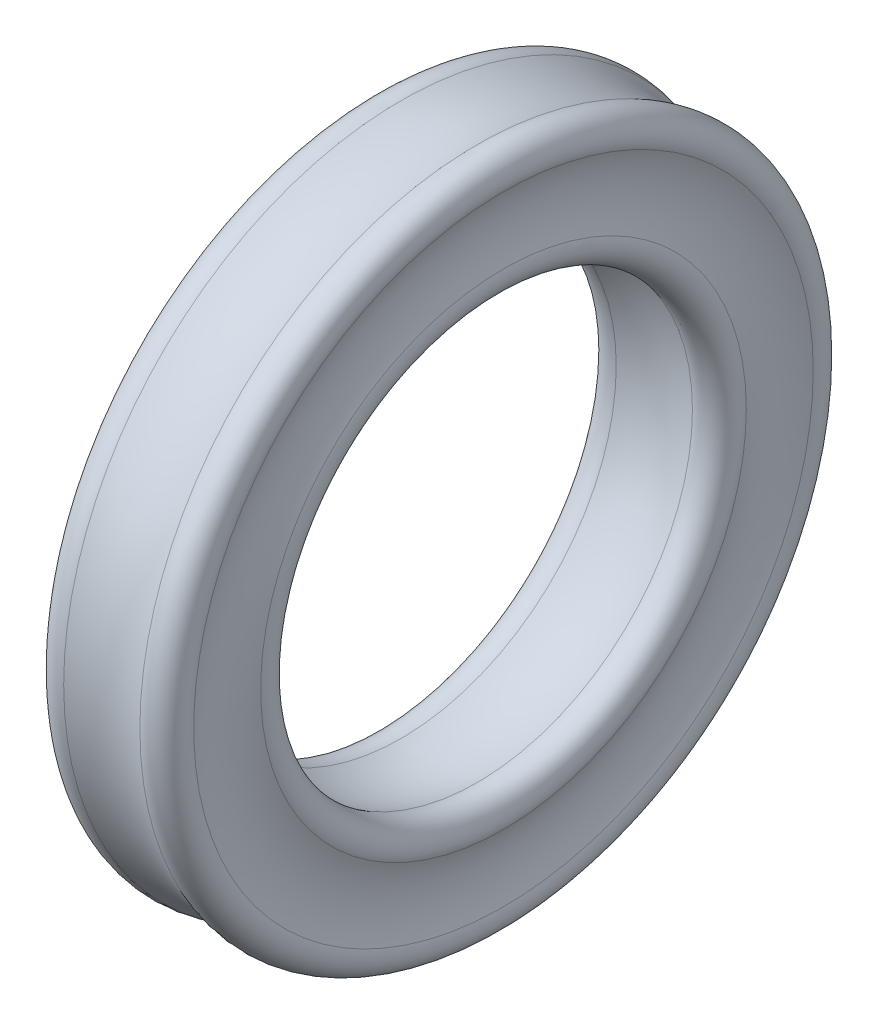
ISO-10303-21;
HEADER;
FILE_DESCRIPTION(('STEP AP214'),'2;1');
FILE_NAME('part.step','',(''),(''),'','','');
FILE_SCHEMA(('AUTOMOTIVE_DESIGN { 1 0 10303 214 1 1 1 1 }'));
ENDSEC;
DATA;
#1=APPLICATION_CONTEXT('core data for automotive mechanical design processes');
#2=APPLICATION_PROTOCOL_DEFINITION('international standard','automotive_design',2000,#1);
#3=PRODUCT_CONTEXT('',#1,'mechanical');
#4=PRODUCT('Part','Part','',(#3));
#5=PRODUCT_RELATED_PRODUCT_CATEGORY('part','',(#4));
#6=PRODUCT_DEFINITION_FORMATION('','',#4);
#7=PRODUCT_DEFINITION_CONTEXT('part definition',#1,'design');
#8=PRODUCT_DEFINITION('design','',#6,#7);
#9=PRODUCT_DEFINITION_SHAPE('','',#8);
#10=(LENGTH_UNIT() NAMED_UNIT(*) SI_UNIT(.MILLI.,.METRE.));
#11=(NAMED_UNIT(*) PLANE_ANGLE_UNIT() SI_UNIT($,.RADIAN.));
#12=(NAMED_UNIT(*) SI_UNIT($,.STERADIAN.) SOLID_ANGLE_UNIT());
#13=UNCERTAINTY_MEASURE_WITH_UNIT(LENGTH_MEASURE(1.E-05),#10,'distance_accuracy_value','');
#14=(GEOMETRIC_REPRESENTATION_CONTEXT(3) GLOBAL_UNCERTAINTY_ASSIGNED_CONTEXT((#13)) GLOBAL_UNIT_ASSIGNED_CONTEXT((#10,
#11,#12)) REPRESENTATION_CONTEXT('',''));
#15=CARTESIAN_POINT('',(0.,0.,0.));
#16=DIRECTION('',(0.,0.,1.));
#17=DIRECTION('',(1.,0.,0.));
#18=AXIS2_PLACEMENT_3D('',#15,#16,#17);
#19=CARTESIAN_POINT('',(0.,0.,0.));
#20=DIRECTION('',(1.,0.,0.));
#21=DIRECTION('',(0.,0.,-1.));
#22=AXIS2_PLACEMENT_3D('',#19,#20,#21);
#23=TOROIDAL_SURFACE('',#22,4.61618922012803,4.12518600000003);
#24=CARTESIAN_POINT('',(1.49686536342219,0.,0.));
#25=DIRECTION('',(1.,0.,0.));
#26=DIRECTION('',(0.,0.,-1.));
#27=AXIS2_PLACEMENT_3D('',#24,#25,#26);
#28=CIRCLE('',#27,8.46021752626512);
#29=CARTESIAN_POINT('',(1.49686536342219,0.,-8.46021752626512));
#30=VERTEX_POINT('',#29);
#31=EDGE_CURVE('E85',#30,#30,#28,.F.);
#32=ORIENTED_EDGE('',*,*,#31,.F.);
#33=EDGE_LOOP('',(#32));
#34=FACE_BOUND('',#33,.T.);
#35=CARTESIAN_POINT('',(-1.49686531743815,0.,0.));
#36=DIRECTION('',(1.,0.,0.));
#37=DIRECTION('',(0.,0.,-1.));
#38=AXIS2_PLACEMENT_3D('',#35,#36,#37);
#39=CIRCLE('',#38,8.46021754417131);
#40=CARTESIAN_POINT('',(-1.49686531743815,0.,-8.46021754417131));
#41=VERTEX_POINT('',#40);
#42=EDGE_CURVE('E82',#41,#41,#39,.T.);
#43=ORIENTED_EDGE('',*,*,#42,.F.);
#44=EDGE_LOOP('',(#43));
#45=FACE_BOUND('',#44,.T.);
#46=ADVANCED_FACE('F13',(#34,#45),#23,.F.);
#47=CARTESIAN_POINT('',(1.79084,0.,0.));
#48=DIRECTION('',(1.,0.,0.));
#49=DIRECTION('',(0.,0.,-1.));
#50=AXIS2_PLACEMENT_3D('',#47,#48,#49);
#51=TOROIDAL_SURFACE('',#50,9.21516,0.810159999999999);
#52=ORIENTED_EDGE('',*,*,#31,.T.);
#53=EDGE_LOOP('',(#52));
#54=FACE_BOUND('',#53,.T.);
#55=CARTESIAN_POINT('',(2.53259310120723,0.,0.));
#56=DIRECTION('',(1.,0.,0.));
#57=DIRECTION('',(0.,0.,-1.));
#58=AXIS2_PLACEMENT_3D('',#55,#56,#57);
#59=CIRCLE('',#58,9.5409844350098);
#60=CARTESIAN_POINT('',(2.53259310120723,0.,-9.5409844350098));
#61=VERTEX_POINT('',#60);
#62=EDGE_CURVE('E63',#61,#61,#59,.T.);
#63=ORIENTED_EDGE('',*,*,#62,.T.);
#64=EDGE_LOOP('',(#63));
#65=FACE_BOUND('',#64,.T.);
#66=ADVANCED_FACE('F76',(#54,#65),#51,.T.);
#67=CARTESIAN_POINT('',(-1.79084,0.,0.));
#68=DIRECTION('',(1.,0.,0.));
#69=DIRECTION('',(0.,0.,-1.));
#70=AXIS2_PLACEMENT_3D('',#67,#68,#69);
#71=TOROIDAL_SURFACE('',#70,9.21516,0.810159999999999);
#72=CARTESIAN_POINT('',(-2.53259308457556,0.,0.));
#73=DIRECTION('',(1.,0.,0.));
#74=DIRECTION('',(0.,0.,-1.));
#75=AXIS2_PLACEMENT_3D('',#72,#73,#74);
#76=CIRCLE('',#75,9.54098447287251);
#77=CARTESIAN_POINT('',(-2.53259308457556,0.,-9.54098447287251));
#78=VERTEX_POINT('',#77);
#79=EDGE_CURVE('E57',#78,#78,#76,.F.);
#80=ORIENTED_EDGE('',*,*,#79,.T.);
#81=EDGE_LOOP('',(#80));
#82=FACE_BOUND('',#81,.T.);
#83=ORIENTED_EDGE('',*,*,#42,.T.);
#84=EDGE_LOOP('',(#83));
#85=FACE_BOUND('',#84,.T.);
#86=ADVANCED_FACE('F72',(#82,#85),#71,.T.);
#87=CARTESIAN_POINT('',(5.52400531604214,0.,0.));
#88=DIRECTION('',(1.,0.,0.));
#89=DIRECTION('',(0.,0.,-1.));
#90=AXIS2_PLACEMENT_3D('',#87,#88,#89);
#91=TOROIDAL_SURFACE('',#90,10.855,3.26729);
#92=CARTESIAN_POINT('',(2.53259308457556,0.,0.));
#93=DIRECTION('',(1.,0.,0.));
#94=DIRECTION('',(0.,0.,-1.));
#95=AXIS2_PLACEMENT_3D('',#92,#93,#94);
#96=CIRCLE('',#95,12.1690155271275);
#97=CARTESIAN_POINT('',(2.53259308457556,0.,-12.1690155271275));
#98=VERTEX_POINT('',#97);
#99=EDGE_CURVE('E54',#98,#98,#96,.F.);
#100=ORIENTED_EDGE('',*,*,#99,.F.);
#101=EDGE_LOOP('',(#100));
#102=FACE_BOUND('',#101,.T.);
#103=ORIENTED_EDGE('',*,*,#62,.F.);
#104=EDGE_LOOP('',(#103));
#105=FACE_BOUND('',#104,.T.);
#106=ADVANCED_FACE('F69',(#102,#105),#91,.F.);
#107=CARTESIAN_POINT('',(-5.52400531604215,0.,0.));
#108=DIRECTION('',(1.,0.,0.));
#109=DIRECTION('',(0.,0.,-1.));
#110=AXIS2_PLACEMENT_3D('',#107,#108,#109);
#111=TOROIDAL_SURFACE('',#110,10.855,3.26729000000001);
#112=ORIENTED_EDGE('',*,*,#79,.F.);
#113=EDGE_LOOP('',(#112));
#114=FACE_BOUND('',#113,.T.);
#115=CARTESIAN_POINT('',(-2.53259309326813,0.,0.));
#116=DIRECTION('',(1.,0.,0.));
#117=DIRECTION('',(0.,0.,-1.));
#118=AXIS2_PLACEMENT_3D('',#115,#116,#117);
#119=CIRCLE('',#118,12.1690155469165);
#120=CARTESIAN_POINT('',(-2.53259309326813,0.,-12.1690155469165));
#121=VERTEX_POINT('',#120);
#122=EDGE_CURVE('E25',#121,#121,#119,.T.);
#123=ORIENTED_EDGE('',*,*,#122,.F.);
#124=EDGE_LOOP('',(#123));
#125=FACE_BOUND('',#124,.T.);
#126=ADVANCED_FACE('F47',(#114,#125),#111,.F.);
#127=CARTESIAN_POINT('',(1.79084,0.,0.));
#128=DIRECTION('',(1.,0.,0.));
#129=DIRECTION('',(0.,0.,-1.));
#130=AXIS2_PLACEMENT_3D('',#127,#128,#129);
#131=TOROIDAL_SURFACE('',#130,12.49484,0.810159999999998);
#132=ORIENTED_EDGE('',*,*,#99,.T.);
#133=EDGE_LOOP('',(#132));
#134=FACE_BOUND('',#133,.T.);
#135=CARTESIAN_POINT('',(1.49686531743814,0.,0.));
#136=DIRECTION('',(1.,0.,0.));
#137=DIRECTION('',(0.,0.,-1.));
#138=AXIS2_PLACEMENT_3D('',#135,#136,#137);
#139=CIRCLE('',#138,13.2497824558287);
#140=CARTESIAN_POINT('',(1.49686531743814,0.,-13.2497824558287));
#141=VERTEX_POINT('',#140);
#142=EDGE_CURVE('E20',#141,#141,#139,.T.);
#143=ORIENTED_EDGE('',*,*,#142,.T.);
#144=EDGE_LOOP('',(#143));
#145=FACE_BOUND('',#144,.T.);
#146=ADVANCED_FACE('F43',(#134,#145),#131,.T.);
#147=CARTESIAN_POINT('',(-1.79084,0.,0.));
#148=DIRECTION('',(1.,0.,0.));
#149=DIRECTION('',(0.,0.,-1.));
#150=AXIS2_PLACEMENT_3D('',#147,#148,#149);
#151=TOROIDAL_SURFACE('',#150,12.49484,0.810160000000001);
#152=CARTESIAN_POINT('',(-1.49686536342218,0.,0.));
#153=DIRECTION('',(1.,0.,0.));
#154=DIRECTION('',(0.,0.,-1.));
#155=AXIS2_PLACEMENT_3D('',#152,#153,#154);
#156=CIRCLE('',#155,13.2497824737349);
#157=CARTESIAN_POINT('',(-1.49686536342218,0.,-13.2497824737349));
#158=VERTEX_POINT('',#157);
#159=EDGE_CURVE('E8',#158,#158,#156,.F.);
#160=ORIENTED_EDGE('',*,*,#159,.T.);
#161=EDGE_LOOP('',(#160));
#162=FACE_BOUND('',#161,.T.);
#163=ORIENTED_EDGE('',*,*,#122,.T.);
#164=EDGE_LOOP('',(#163));
#165=FACE_BOUND('',#164,.T.);
#166=ADVANCED_FACE('F38',(#162,#165),#151,.T.);
#167=CARTESIAN_POINT('',(0.,0.,0.));
#168=DIRECTION('',(1.,0.,0.));
#169=DIRECTION('',(0.,0.,-1.));
#170=AXIS2_PLACEMENT_3D('',#167,#168,#169);
#171=TOROIDAL_SURFACE('',#170,17.093810779872,4.125186);
#172=ORIENTED_EDGE('',*,*,#159,.F.);
#173=EDGE_LOOP('',(#172));
#174=FACE_BOUND('',#173,.T.);
#175=ORIENTED_EDGE('',*,*,#142,.F.);
#176=EDGE_LOOP('',(#175));
#177=FACE_BOUND('',#176,.T.);
#178=ADVANCED_FACE('F42',(#174,#177),#171,.F.);
#179=CLOSED_SHELL('',(#46,#66,#86,#106,#126,#146,#166,#178));
#180=MANIFOLD_SOLID_BREP('B1',#179);
#181=ADVANCED_BREP_SHAPE_REPRESENTATION('',(#18,#180),#14);
#182=SHAPE_DEFINITION_REPRESENTATION(#9,#181);
ENDSEC;
END-ISO-10303-21;
